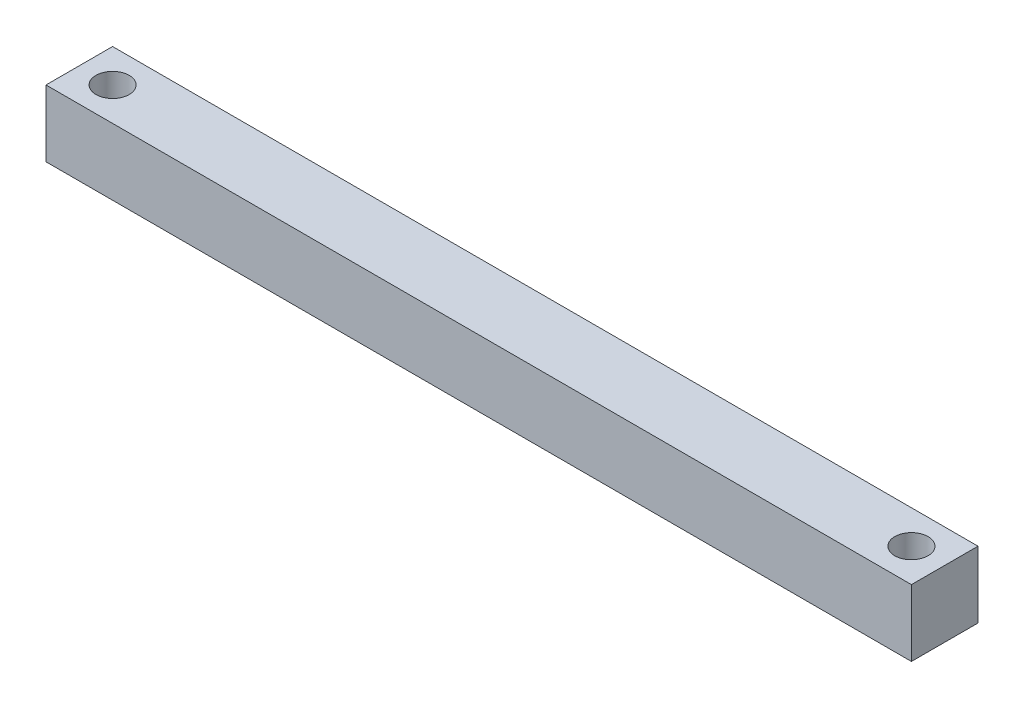
ISO-10303-21;
HEADER;
FILE_DESCRIPTION(('STEP AP214'),'2;1');
FILE_NAME('part.step','',(''),(''),'','','');
FILE_SCHEMA(('AUTOMOTIVE_DESIGN { 1 0 10303 214 1 1 1 1 }'));
ENDSEC;
DATA;
#1=APPLICATION_CONTEXT('core data for automotive mechanical design processes');
#2=APPLICATION_PROTOCOL_DEFINITION('international standard','automotive_design',2000,#1);
#3=PRODUCT_CONTEXT('',#1,'mechanical');
#4=PRODUCT('Part','Part','',(#3));
#5=PRODUCT_RELATED_PRODUCT_CATEGORY('part','',(#4));
#6=PRODUCT_DEFINITION_FORMATION('','',#4);
#7=PRODUCT_DEFINITION_CONTEXT('part definition',#1,'design');
#8=PRODUCT_DEFINITION('design','',#6,#7);
#9=PRODUCT_DEFINITION_SHAPE('','',#8);
#10=(LENGTH_UNIT() NAMED_UNIT(*) SI_UNIT(.MILLI.,.METRE.));
#11=(NAMED_UNIT(*) PLANE_ANGLE_UNIT() SI_UNIT($,.RADIAN.));
#12=(NAMED_UNIT(*) SI_UNIT($,.STERADIAN.) SOLID_ANGLE_UNIT());
#13=UNCERTAINTY_MEASURE_WITH_UNIT(LENGTH_MEASURE(1.E-05),#10,'distance_accuracy_value','');
#14=(GEOMETRIC_REPRESENTATION_CONTEXT(3) GLOBAL_UNCERTAINTY_ASSIGNED_CONTEXT((#13)) GLOBAL_UNIT_ASSIGNED_CONTEXT((#10,
#11,#12)) REPRESENTATION_CONTEXT('',''));
#15=CARTESIAN_POINT('',(0.,0.,0.));
#16=DIRECTION('',(0.,0.,1.));
#17=DIRECTION('',(1.,0.,0.));
#18=AXIS2_PLACEMENT_3D('',#15,#16,#17);
#19=CARTESIAN_POINT('',(330.2,0.,0.));
#20=DIRECTION('',(0.,0.,1.));
#21=DIRECTION('',(1.,0.,0.));
#22=AXIS2_PLACEMENT_3D('',#19,#20,#21);
#23=PLANE('',#22);
#24=DIRECTION('',(0.,1.,0.));
#25=VECTOR('',#24,1.);
#26=CARTESIAN_POINT('',(0.,0.,0.));
#27=LINE('',#26,#25);
#28=CARTESIAN_POINT('',(0.,0.,0.));
#29=VERTEX_POINT('',#28);
#30=CARTESIAN_POINT('',(0.,25.4,0.));
#31=VERTEX_POINT('',#30);
#32=EDGE_CURVE('E116',#29,#31,#27,.T.);
#33=ORIENTED_EDGE('',*,*,#32,.T.);
#34=DIRECTION('',(-1.,0.,0.));
#35=VECTOR('',#34,1.);
#36=CARTESIAN_POINT('',(330.2,25.4,0.));
#37=LINE('',#36,#35);
#38=CARTESIAN_POINT('',(330.2,25.4,0.));
#39=VERTEX_POINT('',#38);
#40=EDGE_CURVE('E11',#39,#31,#37,.T.);
#41=ORIENTED_EDGE('',*,*,#40,.F.);
#42=DIRECTION('',(0.,1.,0.));
#43=VECTOR('',#42,1.);
#44=CARTESIAN_POINT('',(330.2,0.,0.));
#45=LINE('',#44,#43);
#46=CARTESIAN_POINT('',(330.2,0.,0.));
#47=VERTEX_POINT('',#46);
#48=EDGE_CURVE('E98',#47,#39,#45,.T.);
#49=ORIENTED_EDGE('',*,*,#48,.F.);
#50=DIRECTION('',(-1.,0.,0.));
#51=VECTOR('',#50,1.);
#52=CARTESIAN_POINT('',(330.2,0.,0.));
#53=LINE('',#52,#51);
#54=EDGE_CURVE('E112',#47,#29,#53,.T.);
#55=ORIENTED_EDGE('',*,*,#54,.T.);
#56=EDGE_LOOP('',(#33,#41,#49,#55));
#57=FACE_BOUND('',#56,.T.);
#58=ADVANCED_FACE('F38',(#57),#23,.F.);
#59=CARTESIAN_POINT('',(330.2,25.4,0.));
#60=DIRECTION('',(0.,-1.,0.));
#61=DIRECTION('',(0.,0.,-1.));
#62=AXIS2_PLACEMENT_3D('',#59,#60,#61);
#63=PLANE('',#62);
#64=CARTESIAN_POINT('',(12.7,25.4,12.7));
#65=DIRECTION('',(0.,1.,0.));
#66=DIRECTION('',(0.,0.,1.));
#67=AXIS2_PLACEMENT_3D('',#64,#65,#66);
#68=CIRCLE('',#67,6.35);
#69=CARTESIAN_POINT('',(12.7,25.4,19.05));
#70=VERTEX_POINT('',#69);
#71=EDGE_CURVE('E143',#70,#70,#68,.T.);
#72=ORIENTED_EDGE('',*,*,#71,.F.);
#73=EDGE_LOOP('',(#72));
#74=FACE_BOUND('',#73,.T.);
#75=CARTESIAN_POINT('',(317.5,25.4,12.7));
#76=DIRECTION('',(0.,1.,0.));
#77=DIRECTION('',(0.,0.,1.));
#78=AXIS2_PLACEMENT_3D('',#75,#76,#77);
#79=CIRCLE('',#78,6.35);
#80=CARTESIAN_POINT('',(317.5,25.4,19.05));
#81=VERTEX_POINT('',#80);
#82=EDGE_CURVE('E136',#81,#81,#79,.T.);
#83=ORIENTED_EDGE('',*,*,#82,.F.);
#84=EDGE_LOOP('',(#83));
#85=FACE_BOUND('',#84,.T.);
#86=DIRECTION('',(0.,0.,1.));
#87=VECTOR('',#86,1.);
#88=CARTESIAN_POINT('',(0.,25.4,0.));
#89=LINE('',#88,#87);
#90=CARTESIAN_POINT('',(0.,25.4,25.4));
#91=VERTEX_POINT('',#90);
#92=EDGE_CURVE('E103',#31,#91,#89,.T.);
#93=ORIENTED_EDGE('',*,*,#92,.T.);
#94=DIRECTION('',(-1.,0.,0.));
#95=VECTOR('',#94,1.);
#96=CARTESIAN_POINT('',(330.2,25.4,25.4));
#97=LINE('',#96,#95);
#98=CARTESIAN_POINT('',(330.2,25.4,25.4));
#99=VERTEX_POINT('',#98);
#100=EDGE_CURVE('E47',#99,#91,#97,.T.);
#101=ORIENTED_EDGE('',*,*,#100,.F.);
#102=DIRECTION('',(0.,0.,1.));
#103=VECTOR('',#102,1.);
#104=CARTESIAN_POINT('',(330.2,25.4,0.));
#105=LINE('',#104,#103);
#106=EDGE_CURVE('E92',#39,#99,#105,.T.);
#107=ORIENTED_EDGE('',*,*,#106,.F.);
#108=ORIENTED_EDGE('',*,*,#40,.T.);
#109=EDGE_LOOP('',(#93,#101,#107,#108));
#110=FACE_BOUND('',#109,.T.);
#111=ADVANCED_FACE('F102',(#74,#85,#110),#63,.F.);
#112=CARTESIAN_POINT('',(330.2,0.,25.4));
#113=DIRECTION('',(0.,0.,-1.));
#114=DIRECTION('',(-1.,0.,0.));
#115=AXIS2_PLACEMENT_3D('',#112,#113,#114);
#116=PLANE('',#115);
#117=DIRECTION('',(0.,-1.,0.));
#118=VECTOR('',#117,1.);
#119=CARTESIAN_POINT('',(0.,0.,25.4));
#120=LINE('',#119,#118);
#121=CARTESIAN_POINT('',(0.,0.,25.4));
#122=VERTEX_POINT('',#121);
#123=EDGE_CURVE('E78',#91,#122,#120,.T.);
#124=ORIENTED_EDGE('',*,*,#123,.T.);
#125=DIRECTION('',(-1.,0.,0.));
#126=VECTOR('',#125,1.);
#127=CARTESIAN_POINT('',(330.2,0.,25.4));
#128=LINE('',#127,#126);
#129=CARTESIAN_POINT('',(330.2,0.,25.4));
#130=VERTEX_POINT('',#129);
#131=EDGE_CURVE('E105',#130,#122,#128,.T.);
#132=ORIENTED_EDGE('',*,*,#131,.F.);
#133=DIRECTION('',(0.,-1.,0.));
#134=VECTOR('',#133,1.);
#135=CARTESIAN_POINT('',(330.2,0.,25.4));
#136=LINE('',#135,#134);
#137=EDGE_CURVE('E96',#99,#130,#136,.T.);
#138=ORIENTED_EDGE('',*,*,#137,.F.);
#139=ORIENTED_EDGE('',*,*,#100,.T.);
#140=EDGE_LOOP('',(#124,#132,#138,#139));
#141=FACE_BOUND('',#140,.T.);
#142=ADVANCED_FACE('F106',(#141),#116,.F.);
#143=CARTESIAN_POINT('',(330.2,0.,0.));
#144=DIRECTION('',(0.,1.,0.));
#145=DIRECTION('',(0.,0.,1.));
#146=AXIS2_PLACEMENT_3D('',#143,#144,#145);
#147=PLANE('',#146);
#148=CARTESIAN_POINT('',(12.7,0.,12.7));
#149=DIRECTION('',(0.,1.,0.));
#150=DIRECTION('',(0.,0.,1.));
#151=AXIS2_PLACEMENT_3D('',#148,#149,#150);
#152=CIRCLE('',#151,6.35);
#153=CARTESIAN_POINT('',(12.7,0.,19.05));
#154=VERTEX_POINT('',#153);
#155=EDGE_CURVE('E139',#154,#154,#152,.T.);
#156=ORIENTED_EDGE('',*,*,#155,.T.);
#157=EDGE_LOOP('',(#156));
#158=FACE_BOUND('',#157,.T.);
#159=CARTESIAN_POINT('',(317.5,0.,12.7));
#160=DIRECTION('',(0.,1.,0.));
#161=DIRECTION('',(0.,0.,1.));
#162=AXIS2_PLACEMENT_3D('',#159,#160,#161);
#163=CIRCLE('',#162,6.35);
#164=CARTESIAN_POINT('',(317.5,0.,19.05));
#165=VERTEX_POINT('',#164);
#166=EDGE_CURVE('E120',#165,#165,#163,.T.);
#167=ORIENTED_EDGE('',*,*,#166,.T.);
#168=EDGE_LOOP('',(#167));
#169=FACE_BOUND('',#168,.T.);
#170=DIRECTION('',(0.,0.,-1.));
#171=VECTOR('',#170,1.);
#172=CARTESIAN_POINT('',(0.,0.,0.));
#173=LINE('',#172,#171);
#174=EDGE_CURVE('E85',#122,#29,#173,.T.);
#175=ORIENTED_EDGE('',*,*,#174,.T.);
#176=ORIENTED_EDGE('',*,*,#54,.F.);
#177=DIRECTION('',(0.,0.,-1.));
#178=VECTOR('',#177,1.);
#179=CARTESIAN_POINT('',(330.2,0.,0.));
#180=LINE('',#179,#178);
#181=EDGE_CURVE('E58',#130,#47,#180,.T.);
#182=ORIENTED_EDGE('',*,*,#181,.F.);
#183=ORIENTED_EDGE('',*,*,#131,.T.);
#184=EDGE_LOOP('',(#175,#176,#182,#183));
#185=FACE_BOUND('',#184,.T.);
#186=ADVANCED_FACE('F129',(#158,#169,#185),#147,.F.);
#187=CARTESIAN_POINT('',(330.2,0.,0.));
#188=DIRECTION('',(1.,0.,0.));
#189=DIRECTION('',(0.,0.,-1.));
#190=AXIS2_PLACEMENT_3D('',#187,#188,#189);
#191=PLANE('',#190);
#192=ORIENTED_EDGE('',*,*,#48,.T.);
#193=ORIENTED_EDGE('',*,*,#106,.T.);
#194=ORIENTED_EDGE('',*,*,#137,.T.);
#195=ORIENTED_EDGE('',*,*,#181,.T.);
#196=EDGE_LOOP('',(#192,#193,#194,#195));
#197=FACE_BOUND('',#196,.T.);
#198=ADVANCED_FACE('F94',(#197),#191,.T.);
#199=CARTESIAN_POINT('',(0.,0.,0.));
#200=DIRECTION('',(1.,0.,0.));
#201=DIRECTION('',(0.,0.,-1.));
#202=AXIS2_PLACEMENT_3D('',#199,#200,#201);
#203=PLANE('',#202);
#204=ORIENTED_EDGE('',*,*,#32,.F.);
#205=ORIENTED_EDGE('',*,*,#174,.F.);
#206=ORIENTED_EDGE('',*,*,#123,.F.);
#207=ORIENTED_EDGE('',*,*,#92,.F.);
#208=EDGE_LOOP('',(#204,#205,#206,#207));
#209=FACE_BOUND('',#208,.T.);
#210=ADVANCED_FACE('F132',(#209),#203,.F.);
#211=CARTESIAN_POINT('',(317.5,0.,12.7));
#212=DIRECTION('',(0.,1.,0.));
#213=DIRECTION('',(0.,0.,1.));
#214=AXIS2_PLACEMENT_3D('',#211,#212,#213);
#215=CYLINDRICAL_SURFACE('',#214,6.35);
#216=ORIENTED_EDGE('',*,*,#166,.F.);
#217=EDGE_LOOP('',(#216));
#218=FACE_BOUND('',#217,.T.);
#219=ORIENTED_EDGE('',*,*,#82,.T.);
#220=EDGE_LOOP('',(#219));
#221=FACE_BOUND('',#220,.T.);
#222=ADVANCED_FACE('F156',(#218,#221),#215,.F.);
#223=CARTESIAN_POINT('',(12.7,0.,12.7));
#224=DIRECTION('',(0.,1.,0.));
#225=DIRECTION('',(0.,0.,1.));
#226=AXIS2_PLACEMENT_3D('',#223,#224,#225);
#227=CYLINDRICAL_SURFACE('',#226,6.35);
#228=ORIENTED_EDGE('',*,*,#155,.F.);
#229=EDGE_LOOP('',(#228));
#230=FACE_BOUND('',#229,.T.);
#231=ORIENTED_EDGE('',*,*,#71,.T.);
#232=EDGE_LOOP('',(#231));
#233=FACE_BOUND('',#232,.T.);
#234=ADVANCED_FACE('F153',(#230,#233),#227,.F.);
#235=CLOSED_SHELL('',(#58,#111,#142,#186,#198,#210,#222,#234));
#236=MANIFOLD_SOLID_BREP('B2',#235);
#237=ADVANCED_BREP_SHAPE_REPRESENTATION('',(#18,#236),#14);
#238=SHAPE_DEFINITION_REPRESENTATION(#9,#237);
ENDSEC;
END-ISO-10303-21;
